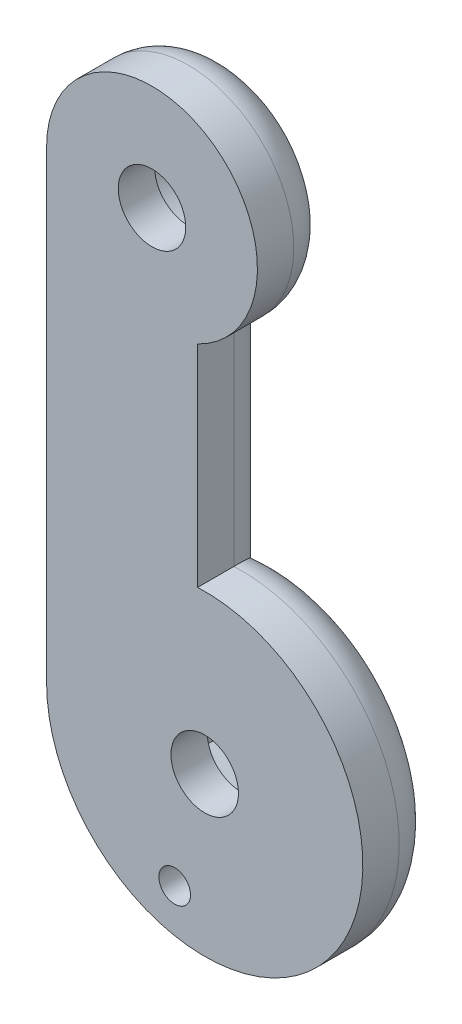
ISO-10303-21;
HEADER;
FILE_DESCRIPTION(('STEP AP214'),'2;1');
FILE_NAME('part.step','',(''),(''),'','','');
FILE_SCHEMA(('AUTOMOTIVE_DESIGN { 1 0 10303 214 1 1 1 1 }'));
ENDSEC;
DATA;
#1=APPLICATION_CONTEXT('core data for automotive mechanical design processes');
#2=APPLICATION_PROTOCOL_DEFINITION('international standard','automotive_design',2000,#1);
#3=PRODUCT_CONTEXT('',#1,'mechanical');
#4=PRODUCT('Part','Part','',(#3));
#5=PRODUCT_RELATED_PRODUCT_CATEGORY('part','',(#4));
#6=PRODUCT_DEFINITION_FORMATION('','',#4);
#7=PRODUCT_DEFINITION_CONTEXT('part definition',#1,'design');
#8=PRODUCT_DEFINITION('design','',#6,#7);
#9=PRODUCT_DEFINITION_SHAPE('','',#8);
#10=(LENGTH_UNIT() NAMED_UNIT(*) SI_UNIT(.MILLI.,.METRE.));
#11=(NAMED_UNIT(*) PLANE_ANGLE_UNIT() SI_UNIT($,.RADIAN.));
#12=(NAMED_UNIT(*) SI_UNIT($,.STERADIAN.) SOLID_ANGLE_UNIT());
#13=UNCERTAINTY_MEASURE_WITH_UNIT(LENGTH_MEASURE(1.E-05),#10,'distance_accuracy_value','');
#14=(GEOMETRIC_REPRESENTATION_CONTEXT(3) GLOBAL_UNCERTAINTY_ASSIGNED_CONTEXT((#13)) GLOBAL_UNIT_ASSIGNED_CONTEXT((#10,
#11,#12)) REPRESENTATION_CONTEXT('',''));
#15=CARTESIAN_POINT('',(0.,0.,0.));
#16=DIRECTION('',(0.,0.,1.));
#17=DIRECTION('',(1.,0.,0.));
#18=AXIS2_PLACEMENT_3D('',#15,#16,#17);
#19=CARTESIAN_POINT('',(0.,0.,3.6));
#20=DIRECTION('',(0.,0.,-1.));
#21=DIRECTION('',(-1.,0.,0.));
#22=AXIS2_PLACEMENT_3D('',#19,#20,#21);
#23=CYLINDRICAL_SURFACE('',#22,1.6);
#24=CARTESIAN_POINT('',(0.,0.,3.6));
#25=DIRECTION('',(0.,0.,1.));
#26=DIRECTION('',(1.,0.,0.));
#27=AXIS2_PLACEMENT_3D('',#24,#25,#26);
#28=CIRCLE('',#27,1.6);
#29=CARTESIAN_POINT('',(1.6,0.,3.6));
#30=VERTEX_POINT('',#29);
#31=EDGE_CURVE('E208',#30,#30,#28,.T.);
#32=ORIENTED_EDGE('',*,*,#31,.T.);
#33=EDGE_LOOP('',(#32));
#34=FACE_BOUND('',#33,.T.);
#35=CARTESIAN_POINT('',(0.,0.,1.875));
#36=DIRECTION('',(0.,0.,-1.));
#37=DIRECTION('',(-1.,0.,0.));
#38=AXIS2_PLACEMENT_3D('',#35,#36,#37);
#39=CIRCLE('',#38,1.6);
#40=CARTESIAN_POINT('',(-1.6,0.,1.875));
#41=VERTEX_POINT('',#40);
#42=EDGE_CURVE('E205',#41,#41,#39,.T.);
#43=ORIENTED_EDGE('',*,*,#42,.T.);
#44=EDGE_LOOP('',(#43));
#45=FACE_BOUND('',#44,.T.);
#46=ADVANCED_FACE('F33',(#34,#45),#23,.F.);
#47=CARTESIAN_POINT('',(-2.5,22.,3.6));
#48=DIRECTION('',(0.,0.,-1.));
#49=DIRECTION('',(-1.,0.,0.));
#50=AXIS2_PLACEMENT_3D('',#47,#48,#49);
#51=CYLINDRICAL_SURFACE('',#50,1.6);
#52=CARTESIAN_POINT('',(-2.5,22.,3.6));
#53=DIRECTION('',(0.,0.,1.));
#54=DIRECTION('',(1.,0.,0.));
#55=AXIS2_PLACEMENT_3D('',#52,#53,#54);
#56=CIRCLE('',#55,1.6);
#57=CARTESIAN_POINT('',(-0.900000000000001,22.,3.6));
#58=VERTEX_POINT('',#57);
#59=EDGE_CURVE('E201',#58,#58,#56,.T.);
#60=ORIENTED_EDGE('',*,*,#59,.T.);
#61=EDGE_LOOP('',(#60));
#62=FACE_BOUND('',#61,.T.);
#63=CARTESIAN_POINT('',(-2.5,22.,1.875));
#64=DIRECTION('',(0.,0.,-1.));
#65=DIRECTION('',(-1.,0.,0.));
#66=AXIS2_PLACEMENT_3D('',#63,#64,#65);
#67=CIRCLE('',#66,1.6);
#68=CARTESIAN_POINT('',(-4.1,22.,1.875));
#69=VERTEX_POINT('',#68);
#70=EDGE_CURVE('E230',#69,#69,#67,.T.);
#71=ORIENTED_EDGE('',*,*,#70,.T.);
#72=EDGE_LOOP('',(#71));
#73=FACE_BOUND('',#72,.T.);
#74=ADVANCED_FACE('F266',(#62,#73),#51,.F.);
#75=CARTESIAN_POINT('',(-2.5,22.,3.6));
#76=DIRECTION('',(0.,0.,1.));
#77=DIRECTION('',(1.,0.,0.));
#78=AXIS2_PLACEMENT_3D('',#75,#76,#77);
#79=PLANE('',#78);
#80=CARTESIAN_POINT('',(-1.42350474806383,-5.31259204458989,3.6));
#81=DIRECTION('',(0.,0.,1.));
#82=DIRECTION('',(1.,0.,0.));
#83=AXIS2_PLACEMENT_3D('',#80,#81,#82);
#84=CIRCLE('',#83,0.749999999999998);
#85=CARTESIAN_POINT('',(-0.67350474806383,-5.31259204458989,3.6));
#86=VERTEX_POINT('',#85);
#87=EDGE_CURVE('E202',#86,#86,#84,.T.);
#88=ORIENTED_EDGE('',*,*,#87,.F.);
#89=EDGE_LOOP('',(#88));
#90=FACE_BOUND('',#89,.T.);
#91=ORIENTED_EDGE('',*,*,#31,.F.);
#92=EDGE_LOOP('',(#91));
#93=FACE_BOUND('',#92,.T.);
#94=CARTESIAN_POINT('',(-2.5,22.,3.6));
#95=DIRECTION('',(0.,0.,1.));
#96=DIRECTION('',(1.,0.,0.));
#97=AXIS2_PLACEMENT_3D('',#94,#95,#96);
#98=CIRCLE('',#97,5.);
#99=CARTESIAN_POINT('',(-0.336184615771112,17.492461538381,3.6));
#100=VERTEX_POINT('',#99);
#101=CARTESIAN_POINT('',(-7.5,22.,3.6));
#102=VERTEX_POINT('',#101);
#103=EDGE_CURVE('E211',#100,#102,#98,.T.);
#104=ORIENTED_EDGE('',*,*,#103,.T.);
#105=DIRECTION('',(0.,-1.,0.));
#106=VECTOR('',#105,1.);
#107=CARTESIAN_POINT('',(-7.5,22.,3.6));
#108=LINE('',#107,#106);
#109=CARTESIAN_POINT('',(-7.5,0.,3.6));
#110=VERTEX_POINT('',#109);
#111=EDGE_CURVE('E214',#102,#110,#108,.T.);
#112=ORIENTED_EDGE('',*,*,#111,.T.);
#113=CARTESIAN_POINT('',(0.,0.,3.6));
#114=DIRECTION('',(0.,0.,1.));
#115=DIRECTION('',(1.,0.,0.));
#116=AXIS2_PLACEMENT_3D('',#113,#114,#115);
#117=CIRCLE('',#116,7.5);
#118=CARTESIAN_POINT('',(-0.336184615771113,7.49246153838102,3.6));
#119=VERTEX_POINT('',#118);
#120=EDGE_CURVE('E216',#110,#119,#117,.T.);
#121=ORIENTED_EDGE('',*,*,#120,.T.);
#122=DIRECTION('',(0.,1.,0.));
#123=VECTOR('',#122,1.);
#124=CARTESIAN_POINT('',(-0.336184615771112,7.49246153838102,3.6));
#125=LINE('',#124,#123);
#126=EDGE_CURVE('E218',#119,#100,#125,.T.);
#127=ORIENTED_EDGE('',*,*,#126,.T.);
#128=EDGE_LOOP('',(#104,#112,#121,#127));
#129=FACE_BOUND('',#128,.T.);
#130=ORIENTED_EDGE('',*,*,#59,.F.);
#131=EDGE_LOOP('',(#130));
#132=FACE_BOUND('',#131,.T.);
#133=ADVANCED_FACE('F269',(#90,#93,#129,#132),#79,.T.);
#134=CARTESIAN_POINT('',(-2.5,22.,0.));
#135=DIRECTION('',(0.,0.,1.));
#136=DIRECTION('',(1.,0.,0.));
#137=AXIS2_PLACEMENT_3D('',#134,#135,#136);
#138=PLANE('',#137);
#139=CARTESIAN_POINT('',(-2.5,22.,0.));
#140=DIRECTION('',(0.,0.,-1.));
#141=DIRECTION('',(-1.,0.,0.));
#142=AXIS2_PLACEMENT_3D('',#139,#140,#141);
#143=CIRCLE('',#142,2.775);
#144=CARTESIAN_POINT('',(-5.275,22.,0.));
#145=VERTEX_POINT('',#144);
#146=EDGE_CURVE('E168',#145,#145,#143,.T.);
#147=ORIENTED_EDGE('',*,*,#146,.F.);
#148=EDGE_LOOP('',(#147));
#149=FACE_BOUND('',#148,.T.);
#150=DIRECTION('',(0.866025403784439,-0.5,0.));
#151=VECTOR('',#150,1.);
#152=CARTESIAN_POINT('',(0.,3.17542648054294,0.));
#153=LINE('',#152,#151);
#154=CARTESIAN_POINT('',(0.,3.17542648054294,0.));
#155=VERTEX_POINT('',#154);
#156=CARTESIAN_POINT('',(2.75,1.58771324027147,0.));
#157=VERTEX_POINT('',#156);
#158=EDGE_CURVE('E179',#155,#157,#153,.T.);
#159=ORIENTED_EDGE('',*,*,#158,.F.);
#160=DIRECTION('',(0.866025403784439,0.5,0.));
#161=VECTOR('',#160,1.);
#162=CARTESIAN_POINT('',(-2.75,1.58771324027147,0.));
#163=LINE('',#162,#161);
#164=CARTESIAN_POINT('',(-2.75,1.58771324027147,0.));
#165=VERTEX_POINT('',#164);
#166=EDGE_CURVE('E144',#165,#155,#163,.T.);
#167=ORIENTED_EDGE('',*,*,#166,.F.);
#168=DIRECTION('',(0.,1.,0.));
#169=VECTOR('',#168,1.);
#170=CARTESIAN_POINT('',(-2.75,-1.58771324027147,0.));
#171=LINE('',#170,#169);
#172=CARTESIAN_POINT('',(-2.75,-1.58771324027147,0.));
#173=VERTEX_POINT('',#172);
#174=EDGE_CURVE('E162',#173,#165,#171,.T.);
#175=ORIENTED_EDGE('',*,*,#174,.F.);
#176=DIRECTION('',(-0.866025403784439,0.5,0.));
#177=VECTOR('',#176,1.);
#178=CARTESIAN_POINT('',(0.,-3.17542648054294,0.));
#179=LINE('',#178,#177);
#180=CARTESIAN_POINT('',(0.,-3.17542648054294,0.));
#181=VERTEX_POINT('',#180);
#182=EDGE_CURVE('E165',#181,#173,#179,.T.);
#183=ORIENTED_EDGE('',*,*,#182,.F.);
#184=DIRECTION('',(-0.866025403784439,-0.5,0.));
#185=VECTOR('',#184,1.);
#186=CARTESIAN_POINT('',(2.75,-1.58771324027147,0.));
#187=LINE('',#186,#185);
#188=CARTESIAN_POINT('',(2.75,-1.58771324027147,0.));
#189=VERTEX_POINT('',#188);
#190=EDGE_CURVE('E184',#189,#181,#187,.T.);
#191=ORIENTED_EDGE('',*,*,#190,.F.);
#192=DIRECTION('',(0.,-1.,0.));
#193=VECTOR('',#192,1.);
#194=CARTESIAN_POINT('',(2.75,1.58771324027147,0.));
#195=LINE('',#194,#193);
#196=EDGE_CURVE('E181',#157,#189,#195,.T.);
#197=ORIENTED_EDGE('',*,*,#196,.F.);
#198=EDGE_LOOP('',(#159,#167,#175,#183,#191,#197));
#199=FACE_BOUND('',#198,.T.);
#200=DIRECTION('',(0.,1.,0.));
#201=VECTOR('',#200,1.);
#202=CARTESIAN_POINT('',(-2.21118461577111,22.,0.));
#203=LINE('',#202,#201);
#204=CARTESIAN_POINT('',(-2.21118461577111,18.8883749143201,0.));
#205=VERTEX_POINT('',#204);
#206=CARTESIAN_POINT('',(-2.21118461577111,5.17216469140119,0.));
#207=VERTEX_POINT('',#206);
#208=EDGE_CURVE('E245',#205,#207,#203,.F.);
#209=ORIENTED_EDGE('',*,*,#208,.T.);
#210=CARTESIAN_POINT('',(0.,0.,0.));
#211=DIRECTION('',(0.,0.,1.));
#212=DIRECTION('',(1.,0.,0.));
#213=AXIS2_PLACEMENT_3D('',#210,#211,#212);
#214=CIRCLE('',#213,5.625);
#215=CARTESIAN_POINT('',(-0.722204289914353,-5.57844476208462,0.));
#216=VERTEX_POINT('',#215);
#217=EDGE_CURVE('E247',#207,#216,#214,.F.);
#218=ORIENTED_EDGE('',*,*,#217,.T.);
#219=CARTESIAN_POINT('',(-1.42350474806383,-5.31259204458989,0.));
#220=DIRECTION('',(0.,0.,1.));
#221=DIRECTION('',(1.,0.,0.));
#222=AXIS2_PLACEMENT_3D('',#219,#220,#221);
#223=CIRCLE('',#222,0.749999999999998);
#224=CARTESIAN_POINT('',(-2.16377511925431,-5.19217702253072,0.));
#225=VERTEX_POINT('',#224);
#226=EDGE_CURVE('E198',#216,#225,#223,.T.);
#227=ORIENTED_EDGE('',*,*,#226,.T.);
#228=CARTESIAN_POINT('',(0.,0.,0.));
#229=DIRECTION('',(0.,0.,1.));
#230=DIRECTION('',(1.,0.,0.));
#231=AXIS2_PLACEMENT_3D('',#228,#229,#230);
#232=CIRCLE('',#231,5.625);
#233=CARTESIAN_POINT('',(-5.625,0.,0.));
#234=VERTEX_POINT('',#233);
#235=EDGE_CURVE('E240',#225,#234,#232,.F.);
#236=ORIENTED_EDGE('',*,*,#235,.T.);
#237=DIRECTION('',(0.,-1.,0.));
#238=VECTOR('',#237,1.);
#239=CARTESIAN_POINT('',(-5.625,22.,0.));
#240=LINE('',#239,#238);
#241=CARTESIAN_POINT('',(-5.625,22.,0.));
#242=VERTEX_POINT('',#241);
#243=EDGE_CURVE('E238',#234,#242,#240,.F.);
#244=ORIENTED_EDGE('',*,*,#243,.T.);
#245=CARTESIAN_POINT('',(-2.5,22.,0.));
#246=DIRECTION('',(0.,0.,1.));
#247=DIRECTION('',(1.,0.,0.));
#248=AXIS2_PLACEMENT_3D('',#245,#246,#247);
#249=CIRCLE('',#248,3.125);
#250=EDGE_CURVE('E242',#242,#205,#249,.F.);
#251=ORIENTED_EDGE('',*,*,#250,.T.);
#252=EDGE_LOOP('',(#209,#218,#227,#236,#244,#251));
#253=FACE_BOUND('',#252,.T.);
#254=ADVANCED_FACE('F276',(#149,#199,#253),#138,.F.);
#255=CARTESIAN_POINT('',(-2.5,22.,3.6));
#256=DIRECTION('',(0.,0.,-1.));
#257=DIRECTION('',(-1.,0.,0.));
#258=AXIS2_PLACEMENT_3D('',#255,#256,#257);
#259=CYLINDRICAL_SURFACE('',#258,5.);
#260=DIRECTION('',(0.,0.,-1.));
#261=VECTOR('',#260,1.);
#262=CARTESIAN_POINT('',(-0.336184615771112,17.492461538381,3.6));
#263=LINE('',#262,#261);
#264=CARTESIAN_POINT('',(-0.336184615771112,17.492461538381,1.875));
#265=VERTEX_POINT('',#264);
#266=EDGE_CURVE('E220',#100,#265,#263,.T.);
#267=ORIENTED_EDGE('',*,*,#266,.T.);
#268=CARTESIAN_POINT('',(-2.5,22.,1.875));
#269=DIRECTION('',(0.,0.,1.));
#270=DIRECTION('',(1.,0.,0.));
#271=AXIS2_PLACEMENT_3D('',#268,#269,#270);
#272=CIRCLE('',#271,5.);
#273=CARTESIAN_POINT('',(-7.5,22.,1.875));
#274=VERTEX_POINT('',#273);
#275=EDGE_CURVE('E229',#265,#274,#272,.T.);
#276=ORIENTED_EDGE('',*,*,#275,.T.);
#277=DIRECTION('',(0.,0.,-1.));
#278=VECTOR('',#277,1.);
#279=CARTESIAN_POINT('',(-7.5,22.,3.6));
#280=LINE('',#279,#278);
#281=EDGE_CURVE('E227',#102,#274,#280,.T.);
#282=ORIENTED_EDGE('',*,*,#281,.F.);
#283=ORIENTED_EDGE('',*,*,#103,.F.);
#284=EDGE_LOOP('',(#267,#276,#282,#283));
#285=FACE_BOUND('',#284,.T.);
#286=ADVANCED_FACE('F280',(#285),#259,.T.);
#287=CARTESIAN_POINT('',(-7.5,22.,3.6));
#288=DIRECTION('',(1.,0.,0.));
#289=DIRECTION('',(0.,1.,0.));
#290=AXIS2_PLACEMENT_3D('',#287,#288,#289);
#291=PLANE('',#290);
#292=ORIENTED_EDGE('',*,*,#281,.T.);
#293=DIRECTION('',(0.,-1.,0.));
#294=VECTOR('',#293,1.);
#295=CARTESIAN_POINT('',(-7.5,22.,1.875));
#296=LINE('',#295,#294);
#297=CARTESIAN_POINT('',(-7.5,0.,1.875));
#298=VERTEX_POINT('',#297);
#299=EDGE_CURVE('E11',#274,#298,#296,.T.);
#300=ORIENTED_EDGE('',*,*,#299,.T.);
#301=DIRECTION('',(0.,0.,-1.));
#302=VECTOR('',#301,1.);
#303=CARTESIAN_POINT('',(-7.5,0.,3.6));
#304=LINE('',#303,#302);
#305=EDGE_CURVE('E225',#110,#298,#304,.T.);
#306=ORIENTED_EDGE('',*,*,#305,.F.);
#307=ORIENTED_EDGE('',*,*,#111,.F.);
#308=EDGE_LOOP('',(#292,#300,#306,#307));
#309=FACE_BOUND('',#308,.T.);
#310=ADVANCED_FACE('F288',(#309),#291,.F.);
#311=CARTESIAN_POINT('',(0.,0.,3.6));
#312=DIRECTION('',(0.,0.,-1.));
#313=DIRECTION('',(-1.,0.,0.));
#314=AXIS2_PLACEMENT_3D('',#311,#312,#313);
#315=CYLINDRICAL_SURFACE('',#314,7.5);
#316=ORIENTED_EDGE('',*,*,#305,.T.);
#317=CARTESIAN_POINT('',(0.,0.,1.875));
#318=DIRECTION('',(0.,0.,1.));
#319=DIRECTION('',(1.,0.,0.));
#320=AXIS2_PLACEMENT_3D('',#317,#318,#319);
#321=CIRCLE('',#320,7.5);
#322=CARTESIAN_POINT('',(-0.336184615771113,7.49246153838102,1.875));
#323=VERTEX_POINT('',#322);
#324=EDGE_CURVE('E61',#298,#323,#321,.T.);
#325=ORIENTED_EDGE('',*,*,#324,.T.);
#326=DIRECTION('',(0.,0.,-1.));
#327=VECTOR('',#326,1.);
#328=CARTESIAN_POINT('',(-0.336184615771113,7.49246153838102,3.6));
#329=LINE('',#328,#327);
#330=EDGE_CURVE('E223',#119,#323,#329,.T.);
#331=ORIENTED_EDGE('',*,*,#330,.F.);
#332=ORIENTED_EDGE('',*,*,#120,.F.);
#333=EDGE_LOOP('',(#316,#325,#331,#332));
#334=FACE_BOUND('',#333,.T.);
#335=ADVANCED_FACE('F284',(#334),#315,.T.);
#336=CARTESIAN_POINT('',(-0.336184615771112,7.49246153838102,3.6));
#337=DIRECTION('',(-1.,0.,0.));
#338=DIRECTION('',(0.,0.,1.));
#339=AXIS2_PLACEMENT_3D('',#336,#337,#338);
#340=PLANE('',#339);
#341=ORIENTED_EDGE('',*,*,#330,.T.);
#342=DIRECTION('',(0.,1.,0.));
#343=VECTOR('',#342,1.);
#344=CARTESIAN_POINT('',(-0.336184615771112,7.49246153838102,1.875));
#345=LINE('',#344,#343);
#346=EDGE_CURVE('E48',#323,#265,#345,.T.);
#347=ORIENTED_EDGE('',*,*,#346,.T.);
#348=ORIENTED_EDGE('',*,*,#266,.F.);
#349=ORIENTED_EDGE('',*,*,#126,.F.);
#350=EDGE_LOOP('',(#341,#347,#348,#349));
#351=FACE_BOUND('',#350,.T.);
#352=ADVANCED_FACE('F263',(#351),#340,.F.);
#353=CARTESIAN_POINT('',(-1.42350474806383,-5.31259204458989,0.));
#354=DIRECTION('',(0.,0.,1.));
#355=DIRECTION('',(1.,0.,0.));
#356=AXIS2_PLACEMENT_3D('',#353,#354,#355);
#357=CYLINDRICAL_SURFACE('',#356,0.749999999999998);
#358=ORIENTED_EDGE('',*,*,#226,.F.);
#359=CARTESIAN_POINT('',(-0.722204289914353,-5.57844476208462,0.));
#360=CARTESIAN_POINT('',(-0.736741134223755,-5.61690146072981,-3.02180247448434E-05));
#361=CARTESIAN_POINT('',(-0.754491408494897,-5.65408757595592,0.00127974141783547));
#362=CARTESIAN_POINT('',(-0.795673424560486,-5.72488297317455,0.00603285309004933));
#363=CARTESIAN_POINT('',(-0.819088661964515,-5.7585022448335,0.00946985288150836));
#364=CARTESIAN_POINT('',(-0.870925662261403,-5.82133474697126,0.0179324771483841));
#365=CARTESIAN_POINT('',(-0.899343318945948,-5.85055155495875,0.0229568013450362));
#366=CARTESIAN_POINT('',(-0.960431547696184,-5.90395435999339,0.0339331871399029));
#367=CARTESIAN_POINT('',(-0.993104693501104,-5.92813728934264,0.0398858106112345));
#368=CARTESIAN_POINT('',(-1.06312999192918,-5.97167510924525,0.0522512736465393));
#369=CARTESIAN_POINT('',(-1.10060818346006,-5.9908250213178,0.0586729655576175));
#370=CARTESIAN_POINT('',(-1.17831070174231,-6.02262167190452,0.0710197735771124));
#371=CARTESIAN_POINT('',(-1.21853523883341,-6.03526791167491,0.0769448515727981));
#372=CARTESIAN_POINT('',(-1.3012116742031,-6.05378074210351,0.0876656842064707));
#373=CARTESIAN_POINT('',(-1.34368521170947,-6.05956013207754,0.0924463102413964));
#374=CARTESIAN_POINT('',(-1.42915847303851,-6.06378931289459,0.100176261758843));
#375=CARTESIAN_POINT('',(-1.47215802014134,-6.06224150142288,0.103126185945857));
#376=CARTESIAN_POINT('',(-1.55576416825756,-6.0519936726214,0.10674027298107));
#377=CARTESIAN_POINT('',(-1.596400237371,-6.04356226372352,0.107485498912553));
#378=CARTESIAN_POINT('',(-1.67570758541229,-6.02012501029665,0.106828454602709));
#379=CARTESIAN_POINT('',(-1.71437912257643,-6.00512003236697,0.105426467369568));
#380=CARTESIAN_POINT('',(-1.78771853185348,-5.96945668633357,0.100709517786796));
#381=CARTESIAN_POINT('',(-1.8224608585054,-5.94894455780622,0.0974418691834538));
#382=CARTESIAN_POINT('',(-1.88810381579808,-5.9027273847436,0.0894069147896186));
#383=CARTESIAN_POINT('',(-1.91900379969065,-5.87702146788925,0.0846393570078916));
#384=CARTESIAN_POINT('',(-1.97701099859262,-5.82035154134225,0.0739852836857116));
#385=CARTESIAN_POINT('',(-2.00399154053332,-5.7892630730304,0.0680717579845407));
#386=CARTESIAN_POINT('',(-2.05249656026223,-5.72314224296655,0.0558780433326673));
#387=CARTESIAN_POINT('',(-2.07401939078608,-5.68810869509411,0.0495977443832586));
#388=CARTESIAN_POINT('',(-2.11176601226001,-5.61359688361145,0.0371540659186202));
#389=CARTESIAN_POINT('',(-2.12776518909605,-5.57400237311151,0.0310035329956576));
#390=CARTESIAN_POINT('',(-2.15284245808504,-5.49253910318301,0.0198663394735338));
#391=CARTESIAN_POINT('',(-2.16192549531312,-5.45067199166509,0.0148788490665287));
#392=CARTESIAN_POINT('',(-2.17197250107867,-5.37252413320776,0.00744920670241133));
#393=CARTESIAN_POINT('',(-2.17399072066292,-5.33640327780435,0.00472973415354212));
#394=CARTESIAN_POINT('',(-2.17281599187537,-5.26411637844375,0.000994808822620989));
#395=CARTESIAN_POINT('',(-2.16961642792737,-5.22795033530414,-1.84773908918826E-05));
#396=CARTESIAN_POINT('',(-2.16377511925431,-5.19217702253072,0.));
#397=B_SPLINE_CURVE_WITH_KNOTS('',3,(#359,#360,#361,#362,#363,#364,#365,#366,#367,#368,#369,
#370,#371,#372,#373,#374,#375,#376,#377,#378,#379,#380,#381,#382,#383,#384,#385,#386,#387,#388,
#389,#390,#391,#392,#393,#394,#395,#396),.UNSPECIFIED.,.F.,.F.,(4,2,2,2,2,2,2,2,2,2,2,2,2,2,2,2,
2,2,4),(0.,0.12310142439163,0.245848432976402,0.368495151231281,0.4912163942553,
0.618352388682587,0.745498131269308,0.874241779245319,1.00294330125983,1.12684996411461,
1.25074029715967,1.3716200581208,1.4925201382597,1.61672301930441,1.74096334316985,
1.86978405515578,1.99851257295881,2.10694641926242,2.21551785468872),.UNSPECIFIED.);
#398=EDGE_CURVE('E250',#216,#225,#397,.T.);
#399=ORIENTED_EDGE('',*,*,#398,.T.);
#400=EDGE_LOOP('',(#358,#399));
#401=FACE_BOUND('',#400,.T.);
#402=ORIENTED_EDGE('',*,*,#87,.T.);
#403=EDGE_LOOP('',(#402));
#404=FACE_BOUND('',#403,.T.);
#405=ADVANCED_FACE('F257',(#401,#404),#357,.F.);
#406=CARTESIAN_POINT('',(-2.5,22.,1.875));
#407=DIRECTION('',(0.,0.,-1.));
#408=DIRECTION('',(-1.,0.,0.));
#409=AXIS2_PLACEMENT_3D('',#406,#407,#408);
#410=CYLINDRICAL_SURFACE('',#409,2.775);
#411=CARTESIAN_POINT('',(-2.5,22.,1.875));
#412=DIRECTION('',(0.,0.,-1.));
#413=DIRECTION('',(-1.,0.,0.));
#414=AXIS2_PLACEMENT_3D('',#411,#412,#413);
#415=CIRCLE('',#414,2.775);
#416=CARTESIAN_POINT('',(-5.275,22.,1.875));
#417=VERTEX_POINT('',#416);
#418=EDGE_CURVE('E233',#417,#417,#415,.T.);
#419=ORIENTED_EDGE('',*,*,#418,.F.);
#420=EDGE_LOOP('',(#419));
#421=FACE_BOUND('',#420,.T.);
#422=ORIENTED_EDGE('',*,*,#146,.T.);
#423=EDGE_LOOP('',(#422));
#424=FACE_BOUND('',#423,.T.);
#425=ADVANCED_FACE('F262',(#421,#424),#410,.F.);
#426=CARTESIAN_POINT('',(-2.5,22.,1.875));
#427=DIRECTION('',(0.,0.,-1.));
#428=DIRECTION('',(-1.,0.,0.));
#429=AXIS2_PLACEMENT_3D('',#426,#427,#428);
#430=PLANE('',#429);
#431=ORIENTED_EDGE('',*,*,#70,.F.);
#432=EDGE_LOOP('',(#431));
#433=FACE_BOUND('',#432,.T.);
#434=ORIENTED_EDGE('',*,*,#418,.T.);
#435=EDGE_LOOP('',(#434));
#436=FACE_BOUND('',#435,.T.);
#437=ADVANCED_FACE('F338',(#433,#436),#430,.T.);
#438=CARTESIAN_POINT('',(-2.75,1.58771324027147,1.875));
#439=DIRECTION('',(-0.5,0.866025403784439,0.));
#440=DIRECTION('',(-0.866025403784439,-0.5,0.));
#441=AXIS2_PLACEMENT_3D('',#438,#439,#440);
#442=PLANE('',#441);
#443=ORIENTED_EDGE('',*,*,#166,.T.);
#444=DIRECTION('',(0.,0.,-1.));
#445=VECTOR('',#444,1.);
#446=CARTESIAN_POINT('',(0.,3.17542648054294,1.875));
#447=LINE('',#446,#445);
#448=CARTESIAN_POINT('',(0.,3.17542648054294,1.875));
#449=VERTEX_POINT('',#448);
#450=EDGE_CURVE('E137',#449,#155,#447,.T.);
#451=ORIENTED_EDGE('',*,*,#450,.F.);
#452=DIRECTION('',(0.866025403784439,0.5,0.));
#453=VECTOR('',#452,1.);
#454=CARTESIAN_POINT('',(-2.75,1.58771324027147,1.875));
#455=LINE('',#454,#453);
#456=CARTESIAN_POINT('',(-2.75,1.58771324027147,1.875));
#457=VERTEX_POINT('',#456);
#458=EDGE_CURVE('E141',#457,#449,#455,.T.);
#459=ORIENTED_EDGE('',*,*,#458,.F.);
#460=DIRECTION('',(0.,0.,-1.));
#461=VECTOR('',#460,1.);
#462=CARTESIAN_POINT('',(-2.75,1.58771324027147,1.875));
#463=LINE('',#462,#461);
#464=EDGE_CURVE('E189',#457,#165,#463,.T.);
#465=ORIENTED_EDGE('',*,*,#464,.T.);
#466=EDGE_LOOP('',(#443,#451,#459,#465));
#467=FACE_BOUND('',#466,.T.);
#468=ADVANCED_FACE('F139',(#467),#442,.F.);
#469=CARTESIAN_POINT('',(-2.75,-1.58771324027147,1.875));
#470=DIRECTION('',(-1.,0.,0.));
#471=DIRECTION('',(0.,-1.,0.));
#472=AXIS2_PLACEMENT_3D('',#469,#470,#471);
#473=PLANE('',#472);
#474=ORIENTED_EDGE('',*,*,#174,.T.);
#475=ORIENTED_EDGE('',*,*,#464,.F.);
#476=DIRECTION('',(0.,1.,0.));
#477=VECTOR('',#476,1.);
#478=CARTESIAN_POINT('',(-2.75,-1.58771324027147,1.875));
#479=LINE('',#478,#477);
#480=CARTESIAN_POINT('',(-2.75,-1.58771324027147,1.875));
#481=VERTEX_POINT('',#480);
#482=EDGE_CURVE('E149',#481,#457,#479,.T.);
#483=ORIENTED_EDGE('',*,*,#482,.F.);
#484=DIRECTION('',(0.,0.,-1.));
#485=VECTOR('',#484,1.);
#486=CARTESIAN_POINT('',(-2.75,-1.58771324027147,1.875));
#487=LINE('',#486,#485);
#488=EDGE_CURVE('E191',#481,#173,#487,.T.);
#489=ORIENTED_EDGE('',*,*,#488,.T.);
#490=EDGE_LOOP('',(#474,#475,#483,#489));
#491=FACE_BOUND('',#490,.T.);
#492=ADVANCED_FACE('F362',(#491),#473,.F.);
#493=CARTESIAN_POINT('',(0.,-3.17542648054294,1.875));
#494=DIRECTION('',(-0.5,-0.866025403784439,0.));
#495=DIRECTION('',(0.866025403784439,-0.5,0.));
#496=AXIS2_PLACEMENT_3D('',#493,#494,#495);
#497=PLANE('',#496);
#498=ORIENTED_EDGE('',*,*,#182,.T.);
#499=ORIENTED_EDGE('',*,*,#488,.F.);
#500=DIRECTION('',(-0.866025403784439,0.5,0.));
#501=VECTOR('',#500,1.);
#502=CARTESIAN_POINT('',(0.,-3.17542648054294,1.875));
#503=LINE('',#502,#501);
#504=CARTESIAN_POINT('',(0.,-3.17542648054294,1.875));
#505=VERTEX_POINT('',#504);
#506=EDGE_CURVE('E175',#505,#481,#503,.T.);
#507=ORIENTED_EDGE('',*,*,#506,.F.);
#508=DIRECTION('',(0.,0.,-1.));
#509=VECTOR('',#508,1.);
#510=CARTESIAN_POINT('',(0.,-3.17542648054294,1.875));
#511=LINE('',#510,#509);
#512=EDGE_CURVE('E193',#505,#181,#511,.T.);
#513=ORIENTED_EDGE('',*,*,#512,.T.);
#514=EDGE_LOOP('',(#498,#499,#507,#513));
#515=FACE_BOUND('',#514,.T.);
#516=ADVANCED_FACE('F360',(#515),#497,.F.);
#517=CARTESIAN_POINT('',(2.75,-1.58771324027147,1.875));
#518=DIRECTION('',(0.5,-0.866025403784439,0.));
#519=DIRECTION('',(0.866025403784439,0.5,0.));
#520=AXIS2_PLACEMENT_3D('',#517,#518,#519);
#521=PLANE('',#520);
#522=ORIENTED_EDGE('',*,*,#190,.T.);
#523=ORIENTED_EDGE('',*,*,#512,.F.);
#524=DIRECTION('',(-0.866025403784439,-0.5,0.));
#525=VECTOR('',#524,1.);
#526=CARTESIAN_POINT('',(2.75,-1.58771324027147,1.875));
#527=LINE('',#526,#525);
#528=CARTESIAN_POINT('',(2.75,-1.58771324027147,1.875));
#529=VERTEX_POINT('',#528);
#530=EDGE_CURVE('E172',#529,#505,#527,.T.);
#531=ORIENTED_EDGE('',*,*,#530,.F.);
#532=DIRECTION('',(0.,0.,-1.));
#533=VECTOR('',#532,1.);
#534=CARTESIAN_POINT('',(2.75,-1.58771324027147,1.875));
#535=LINE('',#534,#533);
#536=EDGE_CURVE('E195',#529,#189,#535,.T.);
#537=ORIENTED_EDGE('',*,*,#536,.T.);
#538=EDGE_LOOP('',(#522,#523,#531,#537));
#539=FACE_BOUND('',#538,.T.);
#540=ADVANCED_FACE('F358',(#539),#521,.F.);
#541=CARTESIAN_POINT('',(2.75,1.58771324027147,1.875));
#542=DIRECTION('',(1.,0.,0.));
#543=DIRECTION('',(0.,1.,0.));
#544=AXIS2_PLACEMENT_3D('',#541,#542,#543);
#545=PLANE('',#544);
#546=ORIENTED_EDGE('',*,*,#196,.T.);
#547=ORIENTED_EDGE('',*,*,#536,.F.);
#548=DIRECTION('',(0.,-1.,0.));
#549=VECTOR('',#548,1.);
#550=CARTESIAN_POINT('',(2.75,1.58771324027147,1.875));
#551=LINE('',#550,#549);
#552=CARTESIAN_POINT('',(2.75,1.58771324027147,1.875));
#553=VERTEX_POINT('',#552);
#554=EDGE_CURVE('E157',#553,#529,#551,.T.);
#555=ORIENTED_EDGE('',*,*,#554,.F.);
#556=DIRECTION('',(0.,0.,-1.));
#557=VECTOR('',#556,1.);
#558=CARTESIAN_POINT('',(2.75,1.58771324027147,1.875));
#559=LINE('',#558,#557);
#560=EDGE_CURVE('E148',#553,#157,#559,.T.);
#561=ORIENTED_EDGE('',*,*,#560,.T.);
#562=EDGE_LOOP('',(#546,#547,#555,#561));
#563=FACE_BOUND('',#562,.T.);
#564=ADVANCED_FACE('F354',(#563),#545,.F.);
#565=CARTESIAN_POINT('',(0.,3.17542648054294,1.875));
#566=DIRECTION('',(0.5,0.866025403784439,0.));
#567=DIRECTION('',(-0.866025403784439,0.5,0.));
#568=AXIS2_PLACEMENT_3D('',#565,#566,#567);
#569=PLANE('',#568);
#570=ORIENTED_EDGE('',*,*,#158,.T.);
#571=ORIENTED_EDGE('',*,*,#560,.F.);
#572=DIRECTION('',(0.866025403784439,-0.5,0.));
#573=VECTOR('',#572,1.);
#574=CARTESIAN_POINT('',(0.,3.17542648054294,1.875));
#575=LINE('',#574,#573);
#576=EDGE_CURVE('E152',#449,#553,#575,.T.);
#577=ORIENTED_EDGE('',*,*,#576,.F.);
#578=ORIENTED_EDGE('',*,*,#450,.T.);
#579=EDGE_LOOP('',(#570,#571,#577,#578));
#580=FACE_BOUND('',#579,.T.);
#581=ADVANCED_FACE('F153',(#580),#569,.F.);
#582=CARTESIAN_POINT('',(0.,0.,1.875));
#583=DIRECTION('',(0.,0.,-1.));
#584=DIRECTION('',(-1.,0.,0.));
#585=AXIS2_PLACEMENT_3D('',#582,#583,#584);
#586=PLANE('',#585);
#587=ORIENTED_EDGE('',*,*,#42,.F.);
#588=EDGE_LOOP('',(#587));
#589=FACE_BOUND('',#588,.T.);
#590=ORIENTED_EDGE('',*,*,#458,.T.);
#591=ORIENTED_EDGE('',*,*,#576,.T.);
#592=ORIENTED_EDGE('',*,*,#554,.T.);
#593=ORIENTED_EDGE('',*,*,#530,.T.);
#594=ORIENTED_EDGE('',*,*,#506,.T.);
#595=ORIENTED_EDGE('',*,*,#482,.T.);
#596=EDGE_LOOP('',(#590,#591,#592,#593,#594,#595));
#597=FACE_BOUND('',#596,.T.);
#598=ADVANCED_FACE('F159',(#589,#597),#586,.T.);
#599=CARTESIAN_POINT('',(0.,0.,1.875));
#600=DIRECTION('',(0.,0.,1.));
#601=DIRECTION('',(1.,0.,0.));
#602=AXIS2_PLACEMENT_3D('',#599,#600,#601);
#603=TOROIDAL_SURFACE('',#602,5.625,1.875);
#604=ORIENTED_EDGE('',*,*,#398,.F.);
#605=ORIENTED_EDGE('',*,*,#217,.F.);
#606=CARTESIAN_POINT('',(-0.336184615771113,7.49246153838102,1.875));
#607=CARTESIAN_POINT('',(-0.336174352931141,7.49247065250671,1.83399632414829));
#608=CARTESIAN_POINT('',(-0.337529316312137,7.49105511310597,1.79299999728455));
#609=CARTESIAN_POINT('',(-0.34289104113645,7.48544511852175,1.71140146970608));
#610=CARTESIAN_POINT('',(-0.346895877114066,7.48125268110161,1.67079900452115));
#611=CARTESIAN_POINT('',(-0.357435526035816,7.47020456356591,1.59063699612291));
#612=CARTESIAN_POINT('',(-0.363949331045095,7.46337099640233,1.55107163209975));
#613=CARTESIAN_POINT('',(-0.379364449902529,7.44716827193788,1.47294559113844));
#614=CARTESIAN_POINT('',(-0.388266068909477,7.43779879054987,1.43438504330572));
#615=CARTESIAN_POINT('',(-0.418253121030702,7.40616080526337,1.32081307727769));
#616=CARTESIAN_POINT('',(-0.442660206077667,7.3803217610309,1.24762446588885));
#617=CARTESIAN_POINT('',(-0.498751508986086,7.32052356602859,1.10758705767158));
#618=CARTESIAN_POINT('',(-0.530451111321924,7.28654724234035,1.04075209198142));
#619=CARTESIAN_POINT('',(-0.613008877281478,7.19730256270792,0.889345844190662));
#620=CARTESIAN_POINT('',(-0.666511452098775,7.13890365584591,0.808059416827516));
#621=CARTESIAN_POINT('',(-0.780670111710174,7.01247895646345,0.659232001195098));
#622=CARTESIAN_POINT('',(-0.841338846224547,6.94443609679575,0.591715910707169));
#623=CARTESIAN_POINT('',(-0.995180695572962,6.76902173115364,0.442140818070238));
#624=CARTESIAN_POINT('',(-1.09071712276092,6.65770944585477,0.367163940547977));
#625=CARTESIAN_POINT('',(-1.2849256666237,6.42507526428636,0.240637629141368));
#626=CARTESIAN_POINT('',(-1.38360369660908,6.30373371039527,0.189135557595176));
#627=CARTESIAN_POINT('',(-1.60654368640594,6.02099126004057,0.0950243269703412));
#628=CARTESIAN_POINT('',(-1.73064399772543,5.85750649843331,0.058404390032603));
#629=CARTESIAN_POINT('',(-1.97326857683769,5.52339796004343,0.01106302626682));
#630=CARTESIAN_POINT('',(-2.09179950603479,5.35278319816922,0.000309845590699764));
#631=CARTESIAN_POINT('',(-2.20786708723501,5.17718915082746,2.20703871843912E-06));
#632=CARTESIAN_POINT('',(-2.20952628774741,5.17467717908231,7.17966934907514E-09));
#633=CARTESIAN_POINT('',(-2.21118461577111,5.17216469140119,0.));
#634=B_SPLINE_CURVE_WITH_KNOTS('',3,(#606,#607,#608,#609,#610,#611,#612,#613,#614,#615,#616,
#617,#618,#619,#620,#621,#622,#623,#624,#625,#626,#627,#628,#629,#630,#631,#632,#633),
.UNSPECIFIED.,.F.,.F.,(4,2,2,2,2,2,2,2,2,2,2,2,2,4),(0.,0.12295224900816,0.245815255711398,
0.367671124741353,0.489542574181077,0.732420015970963,0.97581461450416,1.31439030207493,
1.6535728360068,2.14505260066022,2.63751962370239,3.26070619941056,3.88312736437014,
3.89215878070596),.UNSPECIFIED.);
#635=EDGE_CURVE('E38',#323,#207,#634,.T.);
#636=ORIENTED_EDGE('',*,*,#635,.F.);
#637=ORIENTED_EDGE('',*,*,#324,.F.);
#638=CARTESIAN_POINT('',(-5.625,0.,1.875));
#639=DIRECTION('',(0.,1.,0.));
#640=DIRECTION('',(0.,0.,1.));
#641=AXIS2_PLACEMENT_3D('',#638,#639,#640);
#642=CIRCLE('',#641,1.875);
#643=EDGE_CURVE('E309',#234,#298,#642,.T.);
#644=ORIENTED_EDGE('',*,*,#643,.F.);
#645=ORIENTED_EDGE('',*,*,#235,.F.);
#646=EDGE_LOOP('',(#604,#605,#636,#637,#644,#645));
#647=FACE_BOUND('',#646,.T.);
#648=ADVANCED_FACE('F35',(#647),#603,.T.);
#649=CARTESIAN_POINT('',(-2.21118461577111,7.49246153838102,1.875));
#650=DIRECTION('',(0.,1.,0.));
#651=DIRECTION('',(0.,0.,1.));
#652=AXIS2_PLACEMENT_3D('',#649,#650,#651);
#653=CYLINDRICAL_SURFACE('',#652,1.875);
#654=ORIENTED_EDGE('',*,*,#635,.T.);
#655=ORIENTED_EDGE('',*,*,#208,.F.);
#656=CARTESIAN_POINT('',(-0.336184615771112,17.492461538381,1.875));
#657=CARTESIAN_POINT('',(-0.336176350860481,17.4924579939303,1.82839338503322));
#658=CARTESIAN_POINT('',(-0.337922146006248,17.493554849888,1.78179114791989));
#659=CARTESIAN_POINT('',(-0.344858824260696,17.4979217703893,1.68896050128616));
#660=CARTESIAN_POINT('',(-0.350048626175915,17.5011911529016,1.64273197905231));
#661=CARTESIAN_POINT('',(-0.363781756347222,17.5098575163699,1.55117483372503));
#662=CARTESIAN_POINT('',(-0.372311055005422,17.5152455968423,1.5058432687151));
#663=CARTESIAN_POINT('',(-0.392597389336655,17.5280932637536,1.4162191790787));
#664=CARTESIAN_POINT('',(-0.404354548469137,17.5355529294266,1.3719266942654));
#665=CARTESIAN_POINT('',(-0.444231536799072,17.5609335426466,1.24113850840976));
#666=CARTESIAN_POINT('',(-0.476981007363935,17.5818711468309,1.15657521097265));
#667=CARTESIAN_POINT('',(-0.553218230170296,17.6310858866994,0.994774493620319));
#668=CARTESIAN_POINT('',(-0.596713992976488,17.6593684983505,0.917542598441846));
#669=CARTESIAN_POINT('',(-0.694893040559346,17.7239892834567,0.768275934348973));
#670=CARTESIAN_POINT('',(-0.750013499251206,17.7606492555781,0.696669266475803));
#671=CARTESIAN_POINT('',(-0.867805992933408,17.8402004302476,0.563953147381199));
#672=CARTESIAN_POINT('',(-0.930480267501588,17.8830934815768,0.502846822422874));
#673=CARTESIAN_POINT('',(-1.07032397926858,17.9805128187905,0.383822595161856));
#674=CARTESIAN_POINT('',(-1.14830095782804,18.0358276897425,0.327502809007828));
#675=CARTESIAN_POINT('',(-1.30863986644501,18.1522510388409,0.228817307350155));
#676=CARTESIAN_POINT('',(-1.39100538687896,18.2133642937182,0.18646322765957));
#677=CARTESIAN_POINT('',(-1.57267547870218,18.351757913457,0.108831307457405));
#678=CARTESIAN_POINT('',(-1.67237791058098,18.4299762625348,0.0761685800649902));
#679=CARTESIAN_POINT('',(-1.87139726435197,18.5917530006284,0.028207675157251));
#680=CARTESIAN_POINT('',(-1.97071443525156,18.6753069599635,0.0128952862008384));
#681=CARTESIAN_POINT('',(-2.11433589351523,18.8010657454936,0.00194089493003798));
#682=CARTESIAN_POINT('',(-2.15975244346211,18.8415778825212,0.000165007619722944));
#683=CARTESIAN_POINT('',(-2.20690757617211,18.8844783092322,3.65857595485744E-06));
#684=CARTESIAN_POINT('',(-2.20904655427617,18.8864261146156,1.61606748746612E-09));
#685=CARTESIAN_POINT('',(-2.21118461577111,18.8883749143201,0.));
#686=B_SPLINE_CURVE_WITH_KNOTS('',3,(#656,#657,#658,#659,#660,#661,#662,#663,#664,#665,#666,
#667,#668,#669,#670,#671,#672,#673,#674,#675,#676,#677,#678,#679,#680,#681,#682,#683,#684,#685),
.UNSPECIFIED.,.F.,.F.,(4,2,2,2,2,2,2,2,2,2,2,2,2,2,4),(0.,0.139766914913068,0.279489972876423,
0.4186322306462,0.557779811081013,0.835602839364462,1.11363359229396,1.40502517549357,
1.69650336484611,2.02812415223912,2.36002054219307,2.75119793290357,3.14205468305647,
3.32462561236441,3.3333044668238),.UNSPECIFIED.);
#687=EDGE_CURVE('E303',#265,#205,#686,.T.);
#688=ORIENTED_EDGE('',*,*,#687,.F.);
#689=ORIENTED_EDGE('',*,*,#346,.F.);
#690=EDGE_LOOP('',(#654,#655,#688,#689));
#691=FACE_BOUND('',#690,.T.);
#692=ADVANCED_FACE('F293',(#691),#653,.T.);
#693=CARTESIAN_POINT('',(-5.625,22.,1.875));
#694=DIRECTION('',(0.,-1.,0.));
#695=DIRECTION('',(1.,0.,0.));
#696=AXIS2_PLACEMENT_3D('',#693,#694,#695);
#697=CYLINDRICAL_SURFACE('',#696,1.875);
#698=ORIENTED_EDGE('',*,*,#643,.T.);
#699=ORIENTED_EDGE('',*,*,#299,.F.);
#700=CARTESIAN_POINT('',(-5.625,22.,1.875));
#701=DIRECTION('',(0.,1.,0.));
#702=DIRECTION('',(0.,0.,1.));
#703=AXIS2_PLACEMENT_3D('',#700,#701,#702);
#704=CIRCLE('',#703,1.875);
#705=EDGE_CURVE('E310',#242,#274,#704,.T.);
#706=ORIENTED_EDGE('',*,*,#705,.F.);
#707=ORIENTED_EDGE('',*,*,#243,.F.);
#708=EDGE_LOOP('',(#698,#699,#706,#707));
#709=FACE_BOUND('',#708,.T.);
#710=ADVANCED_FACE('F297',(#709),#697,.T.);
#711=CARTESIAN_POINT('',(-2.5,22.,1.875));
#712=DIRECTION('',(0.,0.,1.));
#713=DIRECTION('',(1.,0.,0.));
#714=AXIS2_PLACEMENT_3D('',#711,#712,#713);
#715=TOROIDAL_SURFACE('',#714,3.125,1.875);
#716=ORIENTED_EDGE('',*,*,#687,.T.);
#717=ORIENTED_EDGE('',*,*,#250,.F.);
#718=ORIENTED_EDGE('',*,*,#705,.T.);
#719=ORIENTED_EDGE('',*,*,#275,.F.);
#720=EDGE_LOOP('',(#716,#717,#718,#719));
#721=FACE_BOUND('',#720,.T.);
#722=ADVANCED_FACE('F299',(#721),#715,.T.);
#723=CLOSED_SHELL('',(#46,#74,#133,#254,#286,#310,#335,#352,#405,#425,#437,#468,#492,#516,#540,
#564,#581,#598,#648,#692,#710,#722));
#724=MANIFOLD_SOLID_BREP('B2',#723);
#725=ADVANCED_BREP_SHAPE_REPRESENTATION('',(#18,#724),#14);
#726=SHAPE_DEFINITION_REPRESENTATION(#9,#725);
ENDSEC;
END-ISO-10303-21;
